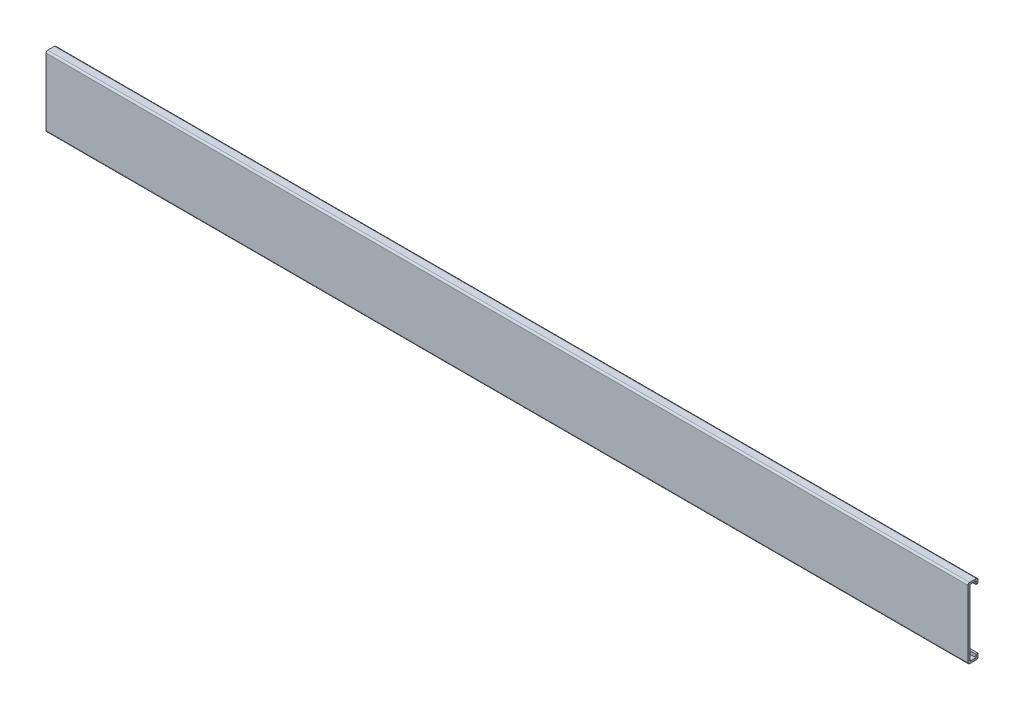
ISO-10303-21;
HEADER;
FILE_DESCRIPTION(('STEP AP214'),'2;1');
FILE_NAME('part.step','',(''),(''),'','','');
FILE_SCHEMA(('AUTOMOTIVE_DESIGN { 1 0 10303 214 1 1 1 1 }'));
ENDSEC;
DATA;
#1=APPLICATION_CONTEXT('core data for automotive mechanical design processes');
#2=APPLICATION_PROTOCOL_DEFINITION('international standard','automotive_design',2000,#1);
#3=PRODUCT_CONTEXT('',#1,'mechanical');
#4=PRODUCT('Part','Part','',(#3));
#5=PRODUCT_RELATED_PRODUCT_CATEGORY('part','',(#4));
#6=PRODUCT_DEFINITION_FORMATION('','',#4);
#7=PRODUCT_DEFINITION_CONTEXT('part definition',#1,'design');
#8=PRODUCT_DEFINITION('design','',#6,#7);
#9=PRODUCT_DEFINITION_SHAPE('','',#8);
#10=(LENGTH_UNIT() NAMED_UNIT(*) SI_UNIT(.MILLI.,.METRE.));
#11=(NAMED_UNIT(*) PLANE_ANGLE_UNIT() SI_UNIT($,.RADIAN.));
#12=(NAMED_UNIT(*) SI_UNIT($,.STERADIAN.) SOLID_ANGLE_UNIT());
#13=UNCERTAINTY_MEASURE_WITH_UNIT(LENGTH_MEASURE(1.E-05),#10,'distance_accuracy_value','');
#14=(GEOMETRIC_REPRESENTATION_CONTEXT(3) GLOBAL_UNCERTAINTY_ASSIGNED_CONTEXT((#13)) GLOBAL_UNIT_ASSIGNED_CONTEXT((#10,
#11,#12)) REPRESENTATION_CONTEXT('',''));
#15=CARTESIAN_POINT('',(0.,0.,0.));
#16=DIRECTION('',(0.,0.,1.));
#17=DIRECTION('',(1.,0.,0.));
#18=AXIS2_PLACEMENT_3D('',#15,#16,#17);
#19=CARTESIAN_POINT('',(550.,20.,-4.8));
#20=DIRECTION('',(0.,0.,-1.));
#21=DIRECTION('',(-1.,0.,0.));
#22=AXIS2_PLACEMENT_3D('',#19,#20,#21);
#23=PLANE('',#22);
#24=DIRECTION('',(0.,1.,0.));
#25=VECTOR('',#24,1.);
#26=CARTESIAN_POINT('',(0.,20.,-4.8));
#27=LINE('',#26,#25);
#28=CARTESIAN_POINT('',(0.,19.8,-4.8));
#29=VERTEX_POINT('',#28);
#30=CARTESIAN_POINT('',(0.,18.,-4.8));
#31=VERTEX_POINT('',#30);
#32=EDGE_CURVE('E179',#29,#31,#27,.F.);
#33=ORIENTED_EDGE('',*,*,#32,.T.);
#34=DIRECTION('',(-1.,0.,0.));
#35=VECTOR('',#34,1.);
#36=CARTESIAN_POINT('',(550.,18.,-4.8));
#37=LINE('',#36,#35);
#38=CARTESIAN_POINT('',(550.,18.,-4.8));
#39=VERTEX_POINT('',#38);
#40=EDGE_CURVE('E11',#39,#31,#37,.T.);
#41=ORIENTED_EDGE('',*,*,#40,.F.);
#42=DIRECTION('',(0.,1.,0.));
#43=VECTOR('',#42,1.);
#44=CARTESIAN_POINT('',(550.,20.,-4.8));
#45=LINE('',#44,#43);
#46=CARTESIAN_POINT('',(550.,19.8,-4.8));
#47=VERTEX_POINT('',#46);
#48=EDGE_CURVE('E115',#47,#39,#45,.F.);
#49=ORIENTED_EDGE('',*,*,#48,.F.);
#50=DIRECTION('',(-1.,0.,0.));
#51=VECTOR('',#50,1.);
#52=CARTESIAN_POINT('',(550.,19.8,-4.8));
#53=LINE('',#52,#51);
#54=EDGE_CURVE('E175',#47,#29,#53,.T.);
#55=ORIENTED_EDGE('',*,*,#54,.T.);
#56=EDGE_LOOP('',(#33,#41,#49,#55));
#57=FACE_BOUND('',#56,.T.);
#58=ADVANCED_FACE('F35',(#57),#23,.F.);
#59=CARTESIAN_POINT('',(550.,18.,-6.));
#60=DIRECTION('',(0.,-1.,0.));
#61=DIRECTION('',(0.,0.,-1.));
#62=AXIS2_PLACEMENT_3D('',#59,#60,#61);
#63=PLANE('',#62);
#64=DIRECTION('',(0.,0.,1.));
#65=VECTOR('',#64,1.);
#66=CARTESIAN_POINT('',(0.,18.,-6.));
#67=LINE('',#66,#65);
#68=CARTESIAN_POINT('',(0.,18.,-6.));
#69=VERTEX_POINT('',#68);
#70=EDGE_CURVE('E182',#69,#31,#67,.T.);
#71=ORIENTED_EDGE('',*,*,#70,.F.);
#72=DIRECTION('',(-1.,0.,0.));
#73=VECTOR('',#72,1.);
#74=CARTESIAN_POINT('',(550.,18.,-6.));
#75=LINE('',#74,#73);
#76=CARTESIAN_POINT('',(550.,18.,-6.));
#77=VERTEX_POINT('',#76);
#78=EDGE_CURVE('E43',#77,#69,#75,.T.);
#79=ORIENTED_EDGE('',*,*,#78,.F.);
#80=DIRECTION('',(0.,0.,1.));
#81=VECTOR('',#80,1.);
#82=CARTESIAN_POINT('',(550.,18.,-6.));
#83=LINE('',#82,#81);
#84=EDGE_CURVE('E264',#77,#39,#83,.T.);
#85=ORIENTED_EDGE('',*,*,#84,.T.);
#86=ORIENTED_EDGE('',*,*,#40,.T.);
#87=EDGE_LOOP('',(#71,#79,#85,#86));
#88=FACE_BOUND('',#87,.T.);
#89=ADVANCED_FACE('F251',(#88),#63,.T.);
#90=CARTESIAN_POINT('',(550.,20.,-6.));
#91=DIRECTION('',(0.,0.,-1.));
#92=DIRECTION('',(-1.,0.,0.));
#93=AXIS2_PLACEMENT_3D('',#90,#91,#92);
#94=PLANE('',#93);
#95=DIRECTION('',(0.,-1.,0.));
#96=VECTOR('',#95,1.);
#97=CARTESIAN_POINT('',(0.,20.,-6.));
#98=LINE('',#97,#96);
#99=CARTESIAN_POINT('',(0.,20.,-6.));
#100=VERTEX_POINT('',#99);
#101=EDGE_CURVE('E185',#100,#69,#98,.T.);
#102=ORIENTED_EDGE('',*,*,#101,.F.);
#103=DIRECTION('',(-1.,0.,0.));
#104=VECTOR('',#103,1.);
#105=CARTESIAN_POINT('',(550.,20.,-6.));
#106=LINE('',#105,#104);
#107=CARTESIAN_POINT('',(550.,20.,-6.));
#108=VERTEX_POINT('',#107);
#109=EDGE_CURVE('E241',#108,#100,#106,.T.);
#110=ORIENTED_EDGE('',*,*,#109,.F.);
#111=DIRECTION('',(0.,-1.,0.));
#112=VECTOR('',#111,1.);
#113=CARTESIAN_POINT('',(550.,20.,-6.));
#114=LINE('',#113,#112);
#115=EDGE_CURVE('E248',#108,#77,#114,.T.);
#116=ORIENTED_EDGE('',*,*,#115,.T.);
#117=ORIENTED_EDGE('',*,*,#78,.T.);
#118=EDGE_LOOP('',(#102,#110,#116,#117));
#119=FACE_BOUND('',#118,.T.);
#120=ADVANCED_FACE('F246',(#119),#94,.T.);
#121=CARTESIAN_POINT('',(550.,20.,-5.));
#122=DIRECTION('',(-1.,0.,0.));
#123=DIRECTION('',(0.,0.,1.));
#124=AXIS2_PLACEMENT_3D('',#121,#122,#123);
#125=CYLINDRICAL_SURFACE('',#124,1.);
#126=CARTESIAN_POINT('',(0.,20.,-5.));
#127=DIRECTION('',(-1.,0.,0.));
#128=DIRECTION('',(0.,0.,1.));
#129=AXIS2_PLACEMENT_3D('',#126,#127,#128);
#130=CIRCLE('',#129,1.);
#131=CARTESIAN_POINT('',(0.,21.,-5.));
#132=VERTEX_POINT('',#131);
#133=EDGE_CURVE('E188',#132,#100,#130,.T.);
#134=ORIENTED_EDGE('',*,*,#133,.F.);
#135=DIRECTION('',(-1.,0.,0.));
#136=VECTOR('',#135,1.);
#137=CARTESIAN_POINT('',(550.,21.,-5.));
#138=LINE('',#137,#136);
#139=CARTESIAN_POINT('',(550.,21.,-5.));
#140=VERTEX_POINT('',#139);
#141=EDGE_CURVE('E239',#140,#132,#138,.T.);
#142=ORIENTED_EDGE('',*,*,#141,.F.);
#143=CARTESIAN_POINT('',(550.,20.,-5.));
#144=DIRECTION('',(-1.,0.,0.));
#145=DIRECTION('',(0.,0.,1.));
#146=AXIS2_PLACEMENT_3D('',#143,#144,#145);
#147=CIRCLE('',#146,1.);
#148=EDGE_CURVE('E261',#140,#108,#147,.T.);
#149=ORIENTED_EDGE('',*,*,#148,.T.);
#150=ORIENTED_EDGE('',*,*,#109,.T.);
#151=EDGE_LOOP('',(#134,#142,#149,#150));
#152=FACE_BOUND('',#151,.T.);
#153=ADVANCED_FACE('F258',(#152),#125,.T.);
#154=CARTESIAN_POINT('',(550.,21.,-1.));
#155=DIRECTION('',(0.,1.,0.));
#156=DIRECTION('',(0.,0.,1.));
#157=AXIS2_PLACEMENT_3D('',#154,#155,#156);
#158=PLANE('',#157);
#159=DIRECTION('',(0.,0.,-1.));
#160=VECTOR('',#159,1.);
#161=CARTESIAN_POINT('',(0.,21.,-1.));
#162=LINE('',#161,#160);
#163=CARTESIAN_POINT('',(0.,21.,-1.));
#164=VERTEX_POINT('',#163);
#165=EDGE_CURVE('E191',#164,#132,#162,.T.);
#166=ORIENTED_EDGE('',*,*,#165,.F.);
#167=DIRECTION('',(-1.,0.,0.));
#168=VECTOR('',#167,1.);
#169=CARTESIAN_POINT('',(550.,21.,-1.));
#170=LINE('',#169,#168);
#171=CARTESIAN_POINT('',(550.,21.,-1.));
#172=VERTEX_POINT('',#171);
#173=EDGE_CURVE('E237',#172,#164,#170,.T.);
#174=ORIENTED_EDGE('',*,*,#173,.F.);
#175=DIRECTION('',(0.,0.,-1.));
#176=VECTOR('',#175,1.);
#177=CARTESIAN_POINT('',(550.,21.,-1.));
#178=LINE('',#177,#176);
#179=EDGE_CURVE('E266',#172,#140,#178,.T.);
#180=ORIENTED_EDGE('',*,*,#179,.T.);
#181=ORIENTED_EDGE('',*,*,#141,.T.);
#182=EDGE_LOOP('',(#166,#174,#180,#181));
#183=FACE_BOUND('',#182,.T.);
#184=ADVANCED_FACE('F419',(#183),#158,.T.);
#185=CARTESIAN_POINT('',(550.,20.,-1.));
#186=DIRECTION('',(-1.,0.,0.));
#187=DIRECTION('',(0.,0.,1.));
#188=AXIS2_PLACEMENT_3D('',#185,#186,#187);
#189=CYLINDRICAL_SURFACE('',#188,1.);
#190=CARTESIAN_POINT('',(0.,20.,-1.));
#191=DIRECTION('',(-1.,0.,0.));
#192=DIRECTION('',(0.,0.,1.));
#193=AXIS2_PLACEMENT_3D('',#190,#191,#192);
#194=CIRCLE('',#193,1.);
#195=CARTESIAN_POINT('',(0.,20.,0.));
#196=VERTEX_POINT('',#195);
#197=EDGE_CURVE('E194',#196,#164,#194,.T.);
#198=ORIENTED_EDGE('',*,*,#197,.F.);
#199=DIRECTION('',(-1.,0.,0.));
#200=VECTOR('',#199,1.);
#201=CARTESIAN_POINT('',(550.,20.,0.));
#202=LINE('',#201,#200);
#203=CARTESIAN_POINT('',(550.,20.,0.));
#204=VERTEX_POINT('',#203);
#205=EDGE_CURVE('E235',#204,#196,#202,.T.);
#206=ORIENTED_EDGE('',*,*,#205,.F.);
#207=CARTESIAN_POINT('',(550.,20.,-1.));
#208=DIRECTION('',(-1.,0.,0.));
#209=DIRECTION('',(0.,0.,1.));
#210=AXIS2_PLACEMENT_3D('',#207,#208,#209);
#211=CIRCLE('',#210,1.);
#212=EDGE_CURVE('E272',#204,#172,#211,.T.);
#213=ORIENTED_EDGE('',*,*,#212,.T.);
#214=ORIENTED_EDGE('',*,*,#173,.T.);
#215=EDGE_LOOP('',(#198,#206,#213,#214));
#216=FACE_BOUND('',#215,.T.);
#217=ADVANCED_FACE('F409',(#216),#189,.T.);
#218=CARTESIAN_POINT('',(550.,-20.,0.));
#219=DIRECTION('',(0.,0.,1.));
#220=DIRECTION('',(1.,0.,0.));
#221=AXIS2_PLACEMENT_3D('',#218,#219,#220);
#222=PLANE('',#221);
#223=DIRECTION('',(0.,1.,0.));
#224=VECTOR('',#223,1.);
#225=CARTESIAN_POINT('',(0.,-20.,0.));
#226=LINE('',#225,#224);
#227=CARTESIAN_POINT('',(0.,-20.,0.));
#228=VERTEX_POINT('',#227);
#229=EDGE_CURVE('E197',#228,#196,#226,.T.);
#230=ORIENTED_EDGE('',*,*,#229,.F.);
#231=DIRECTION('',(-1.,0.,0.));
#232=VECTOR('',#231,1.);
#233=CARTESIAN_POINT('',(550.,-20.,0.));
#234=LINE('',#233,#232);
#235=CARTESIAN_POINT('',(550.,-20.,0.));
#236=VERTEX_POINT('',#235);
#237=EDGE_CURVE('E233',#236,#228,#234,.T.);
#238=ORIENTED_EDGE('',*,*,#237,.F.);
#239=DIRECTION('',(0.,1.,0.));
#240=VECTOR('',#239,1.);
#241=CARTESIAN_POINT('',(550.,-20.,0.));
#242=LINE('',#241,#240);
#243=EDGE_CURVE('E275',#236,#204,#242,.T.);
#244=ORIENTED_EDGE('',*,*,#243,.T.);
#245=ORIENTED_EDGE('',*,*,#205,.T.);
#246=EDGE_LOOP('',(#230,#238,#244,#245));
#247=FACE_BOUND('',#246,.T.);
#248=ADVANCED_FACE('F399',(#247),#222,.T.);
#249=CARTESIAN_POINT('',(550.,-20.,-1.));
#250=DIRECTION('',(-1.,0.,0.));
#251=DIRECTION('',(0.,0.,1.));
#252=AXIS2_PLACEMENT_3D('',#249,#250,#251);
#253=CYLINDRICAL_SURFACE('',#252,1.);
#254=CARTESIAN_POINT('',(0.,-20.,-1.));
#255=DIRECTION('',(-1.,0.,0.));
#256=DIRECTION('',(0.,0.,-1.));
#257=AXIS2_PLACEMENT_3D('',#254,#255,#256);
#258=CIRCLE('',#257,1.);
#259=CARTESIAN_POINT('',(0.,-21.,-1.));
#260=VERTEX_POINT('',#259);
#261=EDGE_CURVE('E200',#260,#228,#258,.T.);
#262=ORIENTED_EDGE('',*,*,#261,.F.);
#263=DIRECTION('',(-1.,0.,0.));
#264=VECTOR('',#263,1.);
#265=CARTESIAN_POINT('',(550.,-21.,-1.));
#266=LINE('',#265,#264);
#267=CARTESIAN_POINT('',(550.,-21.,-1.));
#268=VERTEX_POINT('',#267);
#269=EDGE_CURVE('E231',#268,#260,#266,.T.);
#270=ORIENTED_EDGE('',*,*,#269,.F.);
#271=CARTESIAN_POINT('',(550.,-20.,-1.));
#272=DIRECTION('',(-1.,0.,0.));
#273=DIRECTION('',(0.,0.,-1.));
#274=AXIS2_PLACEMENT_3D('',#271,#272,#273);
#275=CIRCLE('',#274,1.);
#276=EDGE_CURVE('E278',#268,#236,#275,.T.);
#277=ORIENTED_EDGE('',*,*,#276,.T.);
#278=ORIENTED_EDGE('',*,*,#237,.T.);
#279=EDGE_LOOP('',(#262,#270,#277,#278));
#280=FACE_BOUND('',#279,.T.);
#281=ADVANCED_FACE('F389',(#280),#253,.T.);
#282=CARTESIAN_POINT('',(550.,-21.,-1.));
#283=DIRECTION('',(0.,-1.,0.));
#284=DIRECTION('',(0.,0.,-1.));
#285=AXIS2_PLACEMENT_3D('',#282,#283,#284);
#286=PLANE('',#285);
#287=DIRECTION('',(0.,0.,1.));
#288=VECTOR('',#287,1.);
#289=CARTESIAN_POINT('',(0.,-21.,-1.));
#290=LINE('',#289,#288);
#291=CARTESIAN_POINT('',(0.,-21.,-5.));
#292=VERTEX_POINT('',#291);
#293=EDGE_CURVE('E203',#292,#260,#290,.T.);
#294=ORIENTED_EDGE('',*,*,#293,.F.);
#295=DIRECTION('',(-1.,0.,0.));
#296=VECTOR('',#295,1.);
#297=CARTESIAN_POINT('',(550.,-21.,-5.));
#298=LINE('',#297,#296);
#299=CARTESIAN_POINT('',(550.,-21.,-5.));
#300=VERTEX_POINT('',#299);
#301=EDGE_CURVE('E229',#300,#292,#298,.T.);
#302=ORIENTED_EDGE('',*,*,#301,.F.);
#303=DIRECTION('',(0.,0.,1.));
#304=VECTOR('',#303,1.);
#305=CARTESIAN_POINT('',(550.,-21.,-1.));
#306=LINE('',#305,#304);
#307=EDGE_CURVE('E281',#300,#268,#306,.T.);
#308=ORIENTED_EDGE('',*,*,#307,.T.);
#309=ORIENTED_EDGE('',*,*,#269,.T.);
#310=EDGE_LOOP('',(#294,#302,#308,#309));
#311=FACE_BOUND('',#310,.T.);
#312=ADVANCED_FACE('F379',(#311),#286,.T.);
#313=CARTESIAN_POINT('',(550.,-20.,-5.));
#314=DIRECTION('',(-1.,0.,0.));
#315=DIRECTION('',(0.,0.,1.));
#316=AXIS2_PLACEMENT_3D('',#313,#314,#315);
#317=CYLINDRICAL_SURFACE('',#316,1.);
#318=CARTESIAN_POINT('',(0.,-20.,-5.));
#319=DIRECTION('',(-1.,0.,0.));
#320=DIRECTION('',(0.,0.,-1.));
#321=AXIS2_PLACEMENT_3D('',#318,#319,#320);
#322=CIRCLE('',#321,1.);
#323=CARTESIAN_POINT('',(0.,-20.,-6.));
#324=VERTEX_POINT('',#323);
#325=EDGE_CURVE('E206',#324,#292,#322,.T.);
#326=ORIENTED_EDGE('',*,*,#325,.F.);
#327=DIRECTION('',(-1.,0.,0.));
#328=VECTOR('',#327,1.);
#329=CARTESIAN_POINT('',(550.,-20.,-6.));
#330=LINE('',#329,#328);
#331=CARTESIAN_POINT('',(550.,-20.,-6.));
#332=VERTEX_POINT('',#331);
#333=EDGE_CURVE('E227',#332,#324,#330,.T.);
#334=ORIENTED_EDGE('',*,*,#333,.F.);
#335=CARTESIAN_POINT('',(550.,-20.,-5.));
#336=DIRECTION('',(-1.,0.,0.));
#337=DIRECTION('',(0.,0.,-1.));
#338=AXIS2_PLACEMENT_3D('',#335,#336,#337);
#339=CIRCLE('',#338,1.);
#340=EDGE_CURVE('E284',#332,#300,#339,.T.);
#341=ORIENTED_EDGE('',*,*,#340,.T.);
#342=ORIENTED_EDGE('',*,*,#301,.T.);
#343=EDGE_LOOP('',(#326,#334,#341,#342));
#344=FACE_BOUND('',#343,.T.);
#345=ADVANCED_FACE('F370',(#344),#317,.T.);
#346=CARTESIAN_POINT('',(550.,-20.,-6.));
#347=DIRECTION('',(0.,0.,-1.));
#348=DIRECTION('',(-1.,0.,0.));
#349=AXIS2_PLACEMENT_3D('',#346,#347,#348);
#350=PLANE('',#349);
#351=DIRECTION('',(0.,-1.,0.));
#352=VECTOR('',#351,1.);
#353=CARTESIAN_POINT('',(0.,-20.,-6.));
#354=LINE('',#353,#352);
#355=CARTESIAN_POINT('',(0.,-18.,-6.));
#356=VERTEX_POINT('',#355);
#357=EDGE_CURVE('E209',#356,#324,#354,.T.);
#358=ORIENTED_EDGE('',*,*,#357,.F.);
#359=DIRECTION('',(-1.,0.,0.));
#360=VECTOR('',#359,1.);
#361=CARTESIAN_POINT('',(550.,-18.,-6.));
#362=LINE('',#361,#360);
#363=CARTESIAN_POINT('',(550.,-18.,-6.));
#364=VERTEX_POINT('',#363);
#365=EDGE_CURVE('E225',#364,#356,#362,.T.);
#366=ORIENTED_EDGE('',*,*,#365,.F.);
#367=DIRECTION('',(0.,-1.,0.));
#368=VECTOR('',#367,1.);
#369=CARTESIAN_POINT('',(550.,-20.,-6.));
#370=LINE('',#369,#368);
#371=EDGE_CURVE('E287',#364,#332,#370,.T.);
#372=ORIENTED_EDGE('',*,*,#371,.T.);
#373=ORIENTED_EDGE('',*,*,#333,.T.);
#374=EDGE_LOOP('',(#358,#366,#372,#373));
#375=FACE_BOUND('',#374,.T.);
#376=ADVANCED_FACE('F300',(#375),#350,.T.);
#377=CARTESIAN_POINT('',(550.,-18.,-4.8));
#378=DIRECTION('',(0.,1.,0.));
#379=DIRECTION('',(0.,0.,1.));
#380=AXIS2_PLACEMENT_3D('',#377,#378,#379);
#381=PLANE('',#380);
#382=DIRECTION('',(0.,0.,-1.));
#383=VECTOR('',#382,1.);
#384=CARTESIAN_POINT('',(0.,-18.,-4.8));
#385=LINE('',#384,#383);
#386=CARTESIAN_POINT('',(0.,-18.,-4.8));
#387=VERTEX_POINT('',#386);
#388=EDGE_CURVE('E212',#387,#356,#385,.T.);
#389=ORIENTED_EDGE('',*,*,#388,.F.);
#390=DIRECTION('',(-1.,0.,0.));
#391=VECTOR('',#390,1.);
#392=CARTESIAN_POINT('',(550.,-18.,-4.8));
#393=LINE('',#392,#391);
#394=CARTESIAN_POINT('',(550.,-18.,-4.8));
#395=VERTEX_POINT('',#394);
#396=EDGE_CURVE('E223',#395,#387,#393,.T.);
#397=ORIENTED_EDGE('',*,*,#396,.F.);
#398=DIRECTION('',(0.,0.,-1.));
#399=VECTOR('',#398,1.);
#400=CARTESIAN_POINT('',(550.,-18.,-4.8));
#401=LINE('',#400,#399);
#402=EDGE_CURVE('E290',#395,#364,#401,.T.);
#403=ORIENTED_EDGE('',*,*,#402,.T.);
#404=ORIENTED_EDGE('',*,*,#365,.T.);
#405=EDGE_LOOP('',(#389,#397,#403,#404));
#406=FACE_BOUND('',#405,.T.);
#407=ADVANCED_FACE('F294',(#406),#381,.T.);
#408=CARTESIAN_POINT('',(550.,-20.,-4.8));
#409=DIRECTION('',(0.,0.,-1.));
#410=DIRECTION('',(-1.,0.,0.));
#411=AXIS2_PLACEMENT_3D('',#408,#409,#410);
#412=PLANE('',#411);
#413=DIRECTION('',(0.,1.,0.));
#414=VECTOR('',#413,1.);
#415=CARTESIAN_POINT('',(0.,-20.,-4.8));
#416=LINE('',#415,#414);
#417=CARTESIAN_POINT('',(0.,-19.8,-4.8));
#418=VERTEX_POINT('',#417);
#419=EDGE_CURVE('E215',#387,#418,#416,.F.);
#420=ORIENTED_EDGE('',*,*,#419,.T.);
#421=DIRECTION('',(-1.,0.,0.));
#422=VECTOR('',#421,1.);
#423=CARTESIAN_POINT('',(550.,-19.8,-4.8));
#424=LINE('',#423,#422);
#425=CARTESIAN_POINT('',(550.,-19.8,-4.8));
#426=VERTEX_POINT('',#425);
#427=EDGE_CURVE('E170',#426,#418,#424,.T.);
#428=ORIENTED_EDGE('',*,*,#427,.F.);
#429=DIRECTION('',(0.,1.,0.));
#430=VECTOR('',#429,1.);
#431=CARTESIAN_POINT('',(550.,-20.,-4.8));
#432=LINE('',#431,#430);
#433=EDGE_CURVE('E161',#395,#426,#432,.F.);
#434=ORIENTED_EDGE('',*,*,#433,.F.);
#435=ORIENTED_EDGE('',*,*,#396,.T.);
#436=EDGE_LOOP('',(#420,#428,#434,#435));
#437=FACE_BOUND('',#436,.T.);
#438=ADVANCED_FACE('F304',(#437),#412,.F.);
#439=CARTESIAN_POINT('',(550.,-19.8,-1.));
#440=DIRECTION('',(0.,-1.,0.));
#441=DIRECTION('',(0.,0.,-1.));
#442=AXIS2_PLACEMENT_3D('',#439,#440,#441);
#443=PLANE('',#442);
#444=DIRECTION('',(0.,0.,-1.));
#445=VECTOR('',#444,1.);
#446=CARTESIAN_POINT('',(0.,-19.8,-1.));
#447=LINE('',#446,#445);
#448=CARTESIAN_POINT('',(0.,-19.8,-1.2));
#449=VERTEX_POINT('',#448);
#450=EDGE_CURVE('E169',#418,#449,#447,.F.);
#451=ORIENTED_EDGE('',*,*,#450,.T.);
#452=DIRECTION('',(-1.,0.,0.));
#453=VECTOR('',#452,1.);
#454=CARTESIAN_POINT('',(550.,-19.8,-1.2));
#455=LINE('',#454,#453);
#456=CARTESIAN_POINT('',(550.,-19.8,-1.2));
#457=VERTEX_POINT('',#456);
#458=EDGE_CURVE('E166',#457,#449,#455,.T.);
#459=ORIENTED_EDGE('',*,*,#458,.F.);
#460=DIRECTION('',(0.,0.,-1.));
#461=VECTOR('',#460,1.);
#462=CARTESIAN_POINT('',(550.,-19.8,-1.));
#463=LINE('',#462,#461);
#464=EDGE_CURVE('E154',#426,#457,#463,.F.);
#465=ORIENTED_EDGE('',*,*,#464,.F.);
#466=ORIENTED_EDGE('',*,*,#427,.T.);
#467=EDGE_LOOP('',(#451,#459,#465,#466));
#468=FACE_BOUND('',#467,.T.);
#469=ADVANCED_FACE('F167',(#468),#443,.F.);
#470=CARTESIAN_POINT('',(550.,-20.,-1.2));
#471=DIRECTION('',(0.,0.,1.));
#472=DIRECTION('',(1.,0.,0.));
#473=AXIS2_PLACEMENT_3D('',#470,#471,#472);
#474=PLANE('',#473);
#475=DIRECTION('',(0.,1.,0.));
#476=VECTOR('',#475,1.);
#477=CARTESIAN_POINT('',(0.,-20.,-1.2));
#478=LINE('',#477,#476);
#479=CARTESIAN_POINT('',(0.,19.8,-1.2));
#480=VERTEX_POINT('',#479);
#481=EDGE_CURVE('E103',#449,#480,#478,.T.);
#482=ORIENTED_EDGE('',*,*,#481,.T.);
#483=DIRECTION('',(-1.,0.,0.));
#484=VECTOR('',#483,1.);
#485=CARTESIAN_POINT('',(550.,19.8,-1.2));
#486=LINE('',#485,#484);
#487=CARTESIAN_POINT('',(550.,19.8,-1.2));
#488=VERTEX_POINT('',#487);
#489=EDGE_CURVE('E171',#488,#480,#486,.T.);
#490=ORIENTED_EDGE('',*,*,#489,.F.);
#491=DIRECTION('',(0.,1.,0.));
#492=VECTOR('',#491,1.);
#493=CARTESIAN_POINT('',(550.,-20.,-1.2));
#494=LINE('',#493,#492);
#495=EDGE_CURVE('E158',#457,#488,#494,.T.);
#496=ORIENTED_EDGE('',*,*,#495,.F.);
#497=ORIENTED_EDGE('',*,*,#458,.T.);
#498=EDGE_LOOP('',(#482,#490,#496,#497));
#499=FACE_BOUND('',#498,.T.);
#500=ADVANCED_FACE('F173',(#499),#474,.F.);
#501=CARTESIAN_POINT('',(550.,19.8,-1.));
#502=DIRECTION('',(0.,1.,0.));
#503=DIRECTION('',(0.,0.,1.));
#504=AXIS2_PLACEMENT_3D('',#501,#502,#503);
#505=PLANE('',#504);
#506=DIRECTION('',(0.,0.,-1.));
#507=VECTOR('',#506,1.);
#508=CARTESIAN_POINT('',(0.,19.8,-1.));
#509=LINE('',#508,#507);
#510=EDGE_CURVE('E109',#480,#29,#509,.T.);
#511=ORIENTED_EDGE('',*,*,#510,.T.);
#512=ORIENTED_EDGE('',*,*,#54,.F.);
#513=DIRECTION('',(0.,0.,-1.));
#514=VECTOR('',#513,1.);
#515=CARTESIAN_POINT('',(550.,19.8,-1.));
#516=LINE('',#515,#514);
#517=EDGE_CURVE('E51',#488,#47,#516,.T.);
#518=ORIENTED_EDGE('',*,*,#517,.F.);
#519=ORIENTED_EDGE('',*,*,#489,.T.);
#520=EDGE_LOOP('',(#511,#512,#518,#519));
#521=FACE_BOUND('',#520,.T.);
#522=ADVANCED_FACE('F318',(#521),#505,.F.);
#523=CARTESIAN_POINT('',(550.,20.,-5.));
#524=DIRECTION('',(-1.,0.,0.));
#525=DIRECTION('',(0.,0.,1.));
#526=AXIS2_PLACEMENT_3D('',#523,#524,#525);
#527=PLANE('',#526);
#528=ORIENTED_EDGE('',*,*,#48,.T.);
#529=ORIENTED_EDGE('',*,*,#84,.F.);
#530=ORIENTED_EDGE('',*,*,#115,.F.);
#531=ORIENTED_EDGE('',*,*,#148,.F.);
#532=ORIENTED_EDGE('',*,*,#179,.F.);
#533=ORIENTED_EDGE('',*,*,#212,.F.);
#534=ORIENTED_EDGE('',*,*,#243,.F.);
#535=ORIENTED_EDGE('',*,*,#276,.F.);
#536=ORIENTED_EDGE('',*,*,#307,.F.);
#537=ORIENTED_EDGE('',*,*,#340,.F.);
#538=ORIENTED_EDGE('',*,*,#371,.F.);
#539=ORIENTED_EDGE('',*,*,#402,.F.);
#540=ORIENTED_EDGE('',*,*,#433,.T.);
#541=ORIENTED_EDGE('',*,*,#464,.T.);
#542=ORIENTED_EDGE('',*,*,#495,.T.);
#543=ORIENTED_EDGE('',*,*,#517,.T.);
#544=EDGE_LOOP('',(#528,#529,#530,#531,#532,#533,#534,#535,#536,#537,#538,#539,#540,#541,#542,#543));
#545=FACE_BOUND('',#544,.T.);
#546=ADVANCED_FACE('F156',(#545),#527,.F.);
#547=CARTESIAN_POINT('',(0.,20.,-5.));
#548=DIRECTION('',(-1.,0.,0.));
#549=DIRECTION('',(0.,0.,1.));
#550=AXIS2_PLACEMENT_3D('',#547,#548,#549);
#551=PLANE('',#550);
#552=ORIENTED_EDGE('',*,*,#32,.F.);
#553=ORIENTED_EDGE('',*,*,#510,.F.);
#554=ORIENTED_EDGE('',*,*,#481,.F.);
#555=ORIENTED_EDGE('',*,*,#450,.F.);
#556=ORIENTED_EDGE('',*,*,#419,.F.);
#557=ORIENTED_EDGE('',*,*,#388,.T.);
#558=ORIENTED_EDGE('',*,*,#357,.T.);
#559=ORIENTED_EDGE('',*,*,#325,.T.);
#560=ORIENTED_EDGE('',*,*,#293,.T.);
#561=ORIENTED_EDGE('',*,*,#261,.T.);
#562=ORIENTED_EDGE('',*,*,#229,.T.);
#563=ORIENTED_EDGE('',*,*,#197,.T.);
#564=ORIENTED_EDGE('',*,*,#165,.T.);
#565=ORIENTED_EDGE('',*,*,#133,.T.);
#566=ORIENTED_EDGE('',*,*,#101,.T.);
#567=ORIENTED_EDGE('',*,*,#70,.T.);
#568=EDGE_LOOP('',(#552,#553,#554,#555,#556,#557,#558,#559,#560,#561,#562,#563,#564,#565,#566,#567));
#569=FACE_BOUND('',#568,.T.);
#570=ADVANCED_FACE('F254',(#569),#551,.T.);
#571=CLOSED_SHELL('',(#58,#89,#120,#153,#184,#217,#248,#281,#312,#345,#376,#407,#438,#469,#500,
#522,#546,#570));
#572=MANIFOLD_SOLID_BREP('B2',#571);
#573=ADVANCED_BREP_SHAPE_REPRESENTATION('',(#18,#572),#14);
#574=SHAPE_DEFINITION_REPRESENTATION(#9,#573);
ENDSEC;
END-ISO-10303-21;
